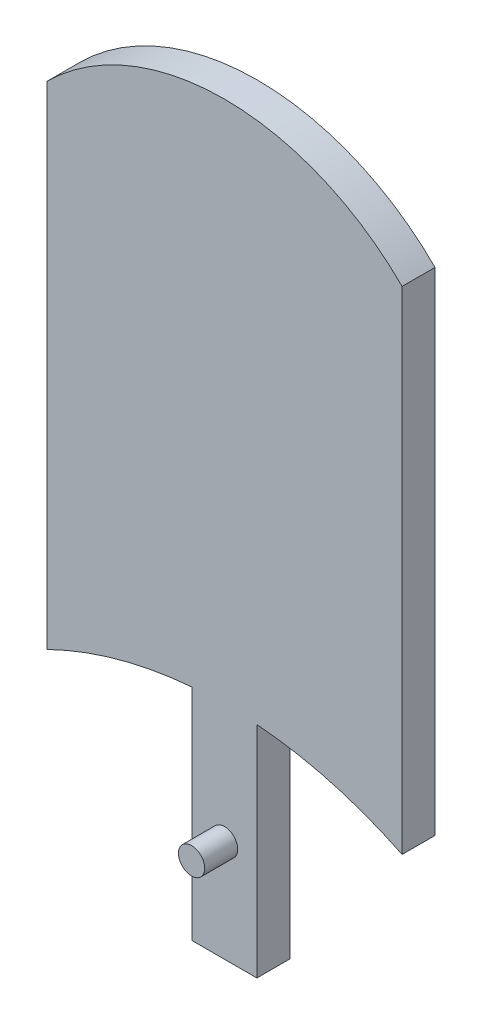
ISO-10303-21;
HEADER;
FILE_DESCRIPTION(('STEP AP214'),'2;1');
FILE_NAME('part.step','',(''),(''),'','','');
FILE_SCHEMA(('AUTOMOTIVE_DESIGN { 1 0 10303 214 1 1 1 1 }'));
ENDSEC;
DATA;
#1=APPLICATION_CONTEXT('core data for automotive mechanical design processes');
#2=APPLICATION_PROTOCOL_DEFINITION('international standard','automotive_design',2000,#1);
#3=PRODUCT_CONTEXT('',#1,'mechanical');
#4=PRODUCT('Part','Part','',(#3));
#5=PRODUCT_RELATED_PRODUCT_CATEGORY('part','',(#4));
#6=PRODUCT_DEFINITION_FORMATION('','',#4);
#7=PRODUCT_DEFINITION_CONTEXT('part definition',#1,'design');
#8=PRODUCT_DEFINITION('design','',#6,#7);
#9=PRODUCT_DEFINITION_SHAPE('','',#8);
#10=(LENGTH_UNIT() NAMED_UNIT(*) SI_UNIT(.MILLI.,.METRE.));
#11=(NAMED_UNIT(*) PLANE_ANGLE_UNIT() SI_UNIT($,.RADIAN.));
#12=(NAMED_UNIT(*) SI_UNIT($,.STERADIAN.) SOLID_ANGLE_UNIT());
#13=UNCERTAINTY_MEASURE_WITH_UNIT(LENGTH_MEASURE(1.E-05),#10,'distance_accuracy_value','');
#14=(GEOMETRIC_REPRESENTATION_CONTEXT(3) GLOBAL_UNCERTAINTY_ASSIGNED_CONTEXT((#13)) GLOBAL_UNIT_ASSIGNED_CONTEXT((#10,
#11,#12)) REPRESENTATION_CONTEXT('',''));
#15=CARTESIAN_POINT('',(0.,0.,0.));
#16=DIRECTION('',(0.,0.,1.));
#17=DIRECTION('',(1.,0.,0.));
#18=AXIS2_PLACEMENT_3D('',#15,#16,#17);
#19=CARTESIAN_POINT('',(0.,23.2983529403055,-3.175));
#20=DIRECTION('',(0.,1.,0.));
#21=DIRECTION('',(0.,0.,1.));
#22=AXIS2_PLACEMENT_3D('',#19,#20,#21);
#23=PLANE('',#22);
#24=DIRECTION('',(0.,0.,-1.));
#25=VECTOR('',#24,1.);
#26=CARTESIAN_POINT('',(1.01599999999999,23.2983529403055,6.351));
#27=LINE('',#26,#25);
#28=CARTESIAN_POINT('',(1.01599999999999,23.2983529403055,-2.286));
#29=VERTEX_POINT('',#28);
#30=CARTESIAN_POINT('',(1.01599999999999,23.2983529403055,-3.175));
#31=VERTEX_POINT('',#30);
#32=EDGE_CURVE('E452',#29,#31,#27,.T.);
#33=ORIENTED_EDGE('',*,*,#32,.F.);
#34=DIRECTION('',(1.,0.,0.));
#35=VECTOR('',#34,1.);
#36=CARTESIAN_POINT('',(-17.1162533328683,23.2983529403055,-2.286));
#37=LINE('',#36,#35);
#38=CARTESIAN_POINT('',(1.65128861988301,23.2983529403055,-2.286));
#39=VERTEX_POINT('',#38);
#40=EDGE_CURVE('E216',#29,#39,#37,.T.);
#41=ORIENTED_EDGE('',*,*,#40,.T.);
#42=DIRECTION('',(0.,0.,1.));
#43=VECTOR('',#42,1.);
#44=CARTESIAN_POINT('',(1.65128861988301,23.2983529403055,-3.175));
#45=LINE('',#44,#43);
#46=CARTESIAN_POINT('',(1.65128861988301,23.2983529403055,0.));
#47=VERTEX_POINT('',#46);
#48=EDGE_CURVE('E312',#39,#47,#45,.T.);
#49=ORIENTED_EDGE('',*,*,#48,.T.);
#50=DIRECTION('',(-1.,0.,0.));
#51=VECTOR('',#50,1.);
#52=CARTESIAN_POINT('',(0.,23.2983529403055,0.));
#53=LINE('',#52,#51);
#54=CARTESIAN_POINT('',(2.85342673515783,23.2983529403055,0.));
#55=VERTEX_POINT('',#54);
#56=EDGE_CURVE('E292',#55,#47,#53,.T.);
#57=ORIENTED_EDGE('',*,*,#56,.F.);
#58=DIRECTION('',(0.,0.,1.));
#59=VECTOR('',#58,1.);
#60=CARTESIAN_POINT('',(2.85342673515783,23.2983529403055,-3.175));
#61=LINE('',#60,#59);
#62=CARTESIAN_POINT('',(2.85342673515783,23.2983529403055,-3.175));
#63=VERTEX_POINT('',#62);
#64=EDGE_CURVE('E308',#63,#55,#61,.T.);
#65=ORIENTED_EDGE('',*,*,#64,.F.);
#66=DIRECTION('',(-1.,0.,0.));
#67=VECTOR('',#66,1.);
#68=CARTESIAN_POINT('',(0.,23.2983529403055,-3.175));
#69=LINE('',#68,#67);
#70=EDGE_CURVE('E274',#63,#31,#69,.T.);
#71=ORIENTED_EDGE('',*,*,#70,.T.);
#72=EDGE_LOOP('',(#33,#41,#49,#57,#65,#71));
#73=FACE_BOUND('',#72,.T.);
#74=ADVANCED_FACE('F47',(#73),#23,.T.);
#75=CARTESIAN_POINT('',(0.,0.,-3.175));
#76=DIRECTION('',(0.,0.,-1.));
#77=DIRECTION('',(-1.,0.,0.));
#78=AXIS2_PLACEMENT_3D('',#75,#76,#77);
#79=PLANE('',#78);
#80=DIRECTION('',(0.,-1.,0.));
#81=VECTOR('',#80,1.);
#82=CARTESIAN_POINT('',(1.01599999999999,-19.7679282566195,-3.175));
#83=LINE('',#82,#81);
#84=CARTESIAN_POINT('',(1.016,-19.7679282566195,-3.175));
#85=VERTEX_POINT('',#84);
#86=EDGE_CURVE('E71',#31,#85,#83,.T.);
#87=ORIENTED_EDGE('',*,*,#86,.F.);
#88=ORIENTED_EDGE('',*,*,#70,.F.);
#89=DIRECTION('',(0.,1.,0.));
#90=VECTOR('',#89,1.);
#91=CARTESIAN_POINT('',(2.85342673515783,0.,-3.175));
#92=LINE('',#91,#90);
#93=CARTESIAN_POINT('',(2.85342673515783,-19.8377816235629,-3.175));
#94=VERTEX_POINT('',#93);
#95=EDGE_CURVE('E278',#94,#63,#92,.T.);
#96=ORIENTED_EDGE('',*,*,#95,.F.);
#97=CARTESIAN_POINT('',(0.,-58.5646946603465,-3.175));
#98=DIRECTION('',(0.,0.,-1.));
#99=DIRECTION('',(-1.,0.,0.));
#100=AXIS2_PLACEMENT_3D('',#97,#98,#99);
#101=CIRCLE('',#100,38.8318920153463);
#102=CARTESIAN_POINT('',(1.65128861988301,-19.7679282566195,-3.175));
#103=VERTEX_POINT('',#102);
#104=EDGE_CURVE('E283',#94,#103,#101,.F.);
#105=ORIENTED_EDGE('',*,*,#104,.T.);
#106=DIRECTION('',(1.,0.,0.));
#107=VECTOR('',#106,1.);
#108=CARTESIAN_POINT('',(-17.1162533328683,-19.7679282566195,-3.175));
#109=LINE('',#108,#107);
#110=EDGE_CURVE('E446',#85,#103,#109,.T.);
#111=ORIENTED_EDGE('',*,*,#110,.F.);
#112=EDGE_LOOP('',(#87,#88,#96,#105,#111));
#113=FACE_BOUND('',#112,.T.);
#114=ADVANCED_FACE('F451',(#113),#79,.T.);
#115=CARTESIAN_POINT('',(-17.1162533328683,23.2983529403055,-2.286));
#116=DIRECTION('',(0.,0.,-1.));
#117=DIRECTION('',(0.,1.,0.));
#118=AXIS2_PLACEMENT_3D('',#115,#116,#117);
#119=PLANE('',#118);
#120=ORIENTED_EDGE('',*,*,#40,.F.);
#121=DIRECTION('',(0.,1.,0.));
#122=VECTOR('',#121,1.);
#123=CARTESIAN_POINT('',(1.01599999999999,-19.7679282566195,-2.28599999999999));
#124=LINE('',#123,#122);
#125=CARTESIAN_POINT('',(1.01599999999999,-19.7679282566195,-2.28599999999999));
#126=VERTEX_POINT('',#125);
#127=EDGE_CURVE('E208',#126,#29,#124,.T.);
#128=ORIENTED_EDGE('',*,*,#127,.F.);
#129=DIRECTION('',(1.,0.,0.));
#130=VECTOR('',#129,1.);
#131=CARTESIAN_POINT('',(-17.1162533328683,-19.7679282566195,-2.28599999999999));
#132=LINE('',#131,#130);
#133=CARTESIAN_POINT('',(1.65128861988301,-19.7679282566195,-2.28599999999999));
#134=VERTEX_POINT('',#133);
#135=EDGE_CURVE('E444',#126,#134,#132,.T.);
#136=ORIENTED_EDGE('',*,*,#135,.T.);
#137=DIRECTION('',(0.,1.,0.));
#138=VECTOR('',#137,1.);
#139=CARTESIAN_POINT('',(1.65128861988301,23.2983529403055,-2.286));
#140=LINE('',#139,#138);
#141=EDGE_CURVE('E215',#134,#39,#140,.T.);
#142=ORIENTED_EDGE('',*,*,#141,.T.);
#143=EDGE_LOOP('',(#120,#128,#136,#142));
#144=FACE_BOUND('',#143,.T.);
#145=ADVANCED_FACE('F457',(#144),#119,.F.);
#146=CARTESIAN_POINT('',(-17.1162533328683,-19.7679282566195,-2.28599999999999));
#147=DIRECTION('',(0.,1.,0.));
#148=DIRECTION('',(0.,0.,1.));
#149=AXIS2_PLACEMENT_3D('',#146,#147,#148);
#150=PLANE('',#149);
#151=ORIENTED_EDGE('',*,*,#135,.F.);
#152=DIRECTION('',(0.,0.,-1.));
#153=VECTOR('',#152,1.);
#154=CARTESIAN_POINT('',(1.01599999999999,-19.7679282566195,6.351));
#155=LINE('',#154,#153);
#156=EDGE_CURVE('E447',#126,#85,#155,.T.);
#157=ORIENTED_EDGE('',*,*,#156,.T.);
#158=ORIENTED_EDGE('',*,*,#110,.T.);
#159=DIRECTION('',(0.,0.,1.));
#160=VECTOR('',#159,1.);
#161=CARTESIAN_POINT('',(1.65128861988301,-19.7679282566195,-3.175));
#162=LINE('',#161,#160);
#163=EDGE_CURVE('E300',#103,#134,#162,.T.);
#164=ORIENTED_EDGE('',*,*,#163,.T.);
#165=EDGE_LOOP('',(#151,#157,#158,#164));
#166=FACE_BOUND('',#165,.T.);
#167=ADVANCED_FACE('F443',(#166),#150,.F.);
#168=CARTESIAN_POINT('',(-1.65128861988301,0.,-3.175));
#169=DIRECTION('',(1.,0.,0.));
#170=DIRECTION('',(0.,0.,-1.));
#171=AXIS2_PLACEMENT_3D('',#168,#169,#170);
#172=PLANE('',#171);
#173=DIRECTION('',(0.,0.,1.));
#174=VECTOR('',#173,1.);
#175=CARTESIAN_POINT('',(-1.65128861988301,-19.7679282566195,-3.175));
#176=LINE('',#175,#174);
#177=CARTESIAN_POINT('',(-1.65128861988301,-19.7679282566195,-2.28599999999999));
#178=VERTEX_POINT('',#177);
#179=CARTESIAN_POINT('',(-1.65128861988301,-19.7679282566195,0.));
#180=VERTEX_POINT('',#179);
#181=EDGE_CURVE('E325',#178,#180,#176,.T.);
#182=ORIENTED_EDGE('',*,*,#181,.F.);
#183=DIRECTION('',(0.,-1.,0.));
#184=VECTOR('',#183,1.);
#185=CARTESIAN_POINT('',(-1.65128861988301,23.2983529403055,-2.286));
#186=LINE('',#185,#184);
#187=CARTESIAN_POINT('',(-1.65128861988301,23.2983529403055,-2.286));
#188=VERTEX_POINT('',#187);
#189=EDGE_CURVE('E196',#188,#178,#186,.T.);
#190=ORIENTED_EDGE('',*,*,#189,.F.);
#191=DIRECTION('',(0.,0.,1.));
#192=VECTOR('',#191,1.);
#193=CARTESIAN_POINT('',(-1.65128861988301,23.2983529403055,-3.175));
#194=LINE('',#193,#192);
#195=CARTESIAN_POINT('',(-1.65128861988301,23.2983529403055,0.));
#196=VERTEX_POINT('',#195);
#197=EDGE_CURVE('E213',#188,#196,#194,.T.);
#198=ORIENTED_EDGE('',*,*,#197,.T.);
#199=DIRECTION('',(0.,1.,0.));
#200=VECTOR('',#199,1.);
#201=CARTESIAN_POINT('',(-1.65128861988301,0.,0.));
#202=LINE('',#201,#200);
#203=EDGE_CURVE('E321',#180,#196,#202,.T.);
#204=ORIENTED_EDGE('',*,*,#203,.F.);
#205=EDGE_LOOP('',(#182,#190,#198,#204));
#206=FACE_BOUND('',#205,.T.);
#207=ADVANCED_FACE('F514',(#206),#172,.T.);
#208=CARTESIAN_POINT('',(1.65128861988301,0.,-3.175));
#209=DIRECTION('',(1.,0.,0.));
#210=DIRECTION('',(0.,0.,-1.));
#211=AXIS2_PLACEMENT_3D('',#208,#209,#210);
#212=PLANE('',#211);
#213=ORIENTED_EDGE('',*,*,#141,.F.);
#214=CARTESIAN_POINT('',(1.65128861988301,-19.7679282566195,0.));
#215=VERTEX_POINT('',#214);
#216=EDGE_CURVE('E287',#134,#215,#162,.T.);
#217=ORIENTED_EDGE('',*,*,#216,.T.);
#218=DIRECTION('',(0.,1.,0.));
#219=VECTOR('',#218,1.);
#220=CARTESIAN_POINT('',(1.65128861988301,0.,0.));
#221=LINE('',#220,#219);
#222=EDGE_CURVE('E288',#215,#47,#221,.T.);
#223=ORIENTED_EDGE('',*,*,#222,.T.);
#224=ORIENTED_EDGE('',*,*,#48,.F.);
#225=EDGE_LOOP('',(#213,#217,#223,#224));
#226=FACE_BOUND('',#225,.T.);
#227=ADVANCED_FACE('F440',(#226),#212,.F.);
#228=CARTESIAN_POINT('',(0.,-58.5646946603465,3.175));
#229=DIRECTION('',(0.,0.,-1.));
#230=DIRECTION('',(-1.,0.,0.));
#231=AXIS2_PLACEMENT_3D('',#228,#229,#230);
#232=CYLINDRICAL_SURFACE('',#231,38.8318920153463);
#233=CARTESIAN_POINT('',(0.,-58.5646946603465,3.175));
#234=DIRECTION('',(0.,0.,1.));
#235=DIRECTION('',(1.,0.,0.));
#236=AXIS2_PLACEMENT_3D('',#233,#234,#235);
#237=CIRCLE('',#236,38.8318920153463);
#238=CARTESIAN_POINT('',(3.11847985069032,-19.8582233549904,3.175));
#239=VERTEX_POINT('',#238);
#240=CARTESIAN_POINT('',(17.1142533328683,-23.707583903,3.175));
#241=VERTEX_POINT('',#240);
#242=EDGE_CURVE('E357',#239,#241,#237,.F.);
#243=ORIENTED_EDGE('',*,*,#242,.F.);
#244=DIRECTION('',(0.,0.,-1.));
#245=VECTOR('',#244,1.);
#246=CARTESIAN_POINT('',(3.11847985069032,-19.8582233549904,3.175));
#247=LINE('',#246,#245);
#248=CARTESIAN_POINT('',(3.11847985069032,-19.8582233549904,0.));
#249=VERTEX_POINT('',#248);
#250=EDGE_CURVE('E269',#239,#249,#247,.T.);
#251=ORIENTED_EDGE('',*,*,#250,.T.);
#252=CARTESIAN_POINT('',(0.,-58.5646946603465,0.));
#253=DIRECTION('',(0.,0.,1.));
#254=DIRECTION('',(1.,0.,0.));
#255=AXIS2_PLACEMENT_3D('',#252,#253,#254);
#256=CIRCLE('',#255,38.8318920153463);
#257=CARTESIAN_POINT('',(17.1142533328683,-23.707583903,0.));
#258=VERTEX_POINT('',#257);
#259=EDGE_CURVE('E373',#249,#258,#256,.F.);
#260=ORIENTED_EDGE('',*,*,#259,.T.);
#261=DIRECTION('',(0.,0.,-1.));
#262=VECTOR('',#261,1.);
#263=CARTESIAN_POINT('',(17.1142533328683,-23.707583903,3.175));
#264=LINE('',#263,#262);
#265=EDGE_CURVE('E383',#241,#258,#264,.T.);
#266=ORIENTED_EDGE('',*,*,#265,.F.);
#267=EDGE_LOOP('',(#243,#251,#260,#266));
#268=FACE_BOUND('',#267,.T.);
#269=ADVANCED_FACE('F413',(#268),#232,.F.);
#270=CARTESIAN_POINT('',(0.,-58.5646946603465,0.));
#271=DIRECTION('',(0.,0.,1.));
#272=DIRECTION('',(1.,0.,0.));
#273=AXIS2_PLACEMENT_3D('',#270,#271,#272);
#274=CIRCLE('',#273,38.8318920153463);
#275=CARTESIAN_POINT('',(-2.85342673515783,-19.8377816235629,0.));
#276=VERTEX_POINT('',#275);
#277=EDGE_CURVE('E261',#276,#180,#274,.F.);
#278=ORIENTED_EDGE('',*,*,#277,.F.);
#279=DIRECTION('',(0.,0.,1.));
#280=VECTOR('',#279,1.);
#281=CARTESIAN_POINT('',(-2.85342673515783,-19.8377816235629,-3.175));
#282=LINE('',#281,#280);
#283=CARTESIAN_POINT('',(-2.85342673515783,-19.8377816235629,-3.175));
#284=VERTEX_POINT('',#283);
#285=EDGE_CURVE('E293',#284,#276,#282,.T.);
#286=ORIENTED_EDGE('',*,*,#285,.F.);
#287=CARTESIAN_POINT('',(0.,-58.5646946603465,-3.175));
#288=DIRECTION('',(0.,0.,-1.));
#289=DIRECTION('',(-1.,0.,0.));
#290=AXIS2_PLACEMENT_3D('',#287,#288,#289);
#291=CIRCLE('',#290,38.8318920153463);
#292=CARTESIAN_POINT('',(-1.65128861988301,-19.7679282566195,-3.175));
#293=VERTEX_POINT('',#292);
#294=EDGE_CURVE('E316',#293,#284,#291,.F.);
#295=ORIENTED_EDGE('',*,*,#294,.F.);
#296=EDGE_CURVE('E335',#293,#178,#176,.T.);
#297=ORIENTED_EDGE('',*,*,#296,.T.);
#298=ORIENTED_EDGE('',*,*,#181,.T.);
#299=EDGE_LOOP('',(#278,#286,#295,#297,#298));
#300=FACE_BOUND('',#299,.T.);
#301=ADVANCED_FACE('F603',(#300),#232,.F.);
#302=CARTESIAN_POINT('',(2.85342673515783,-19.8377816235629,0.));
#303=VERTEX_POINT('',#302);
#304=EDGE_CURVE('E257',#215,#303,#274,.F.);
#305=ORIENTED_EDGE('',*,*,#304,.F.);
#306=ORIENTED_EDGE('',*,*,#216,.F.);
#307=ORIENTED_EDGE('',*,*,#163,.F.);
#308=ORIENTED_EDGE('',*,*,#104,.F.);
#309=DIRECTION('',(0.,0.,1.));
#310=VECTOR('',#309,1.);
#311=CARTESIAN_POINT('',(2.85342673515783,-19.8377816235629,-3.175));
#312=LINE('',#311,#310);
#313=EDGE_CURVE('E304',#94,#303,#312,.T.);
#314=ORIENTED_EDGE('',*,*,#313,.T.);
#315=EDGE_LOOP('',(#305,#306,#307,#308,#314));
#316=FACE_BOUND('',#315,.T.);
#317=ADVANCED_FACE('F427',(#316),#232,.F.);
#318=CARTESIAN_POINT('',(0.,0.,0.));
#319=DIRECTION('',(0.,0.,1.));
#320=DIRECTION('',(1.,0.,0.));
#321=AXIS2_PLACEMENT_3D('',#318,#319,#320);
#322=PLANE('',#321);
#323=DIRECTION('',(0.,-1.,0.));
#324=VECTOR('',#323,1.);
#325=CARTESIAN_POINT('',(-3.11847985069032,0.338888516574702,0.));
#326=LINE('',#325,#324);
#327=CARTESIAN_POINT('',(-3.11847985069039,-19.8582233549904,0.));
#328=VERTEX_POINT('',#327);
#329=CARTESIAN_POINT('',(-3.11847985069047,-41.0138230374253,0.));
#330=VERTEX_POINT('',#329);
#331=EDGE_CURVE('E237',#328,#330,#326,.T.);
#332=ORIENTED_EDGE('',*,*,#331,.F.);
#333=CARTESIAN_POINT('',(-17.1142533328683,-23.707583903,0.));
#334=VERTEX_POINT('',#333);
#335=EDGE_CURVE('E374',#334,#328,#256,.F.);
#336=ORIENTED_EDGE('',*,*,#335,.F.);
#337=DIRECTION('',(0.,1.,0.));
#338=VECTOR('',#337,1.);
#339=CARTESIAN_POINT('',(-17.1142533328683,0.,0.));
#340=LINE('',#339,#338);
#341=CARTESIAN_POINT('',(-17.1142533328683,23.707583903,0.));
#342=VERTEX_POINT('',#341);
#343=EDGE_CURVE('E369',#334,#342,#340,.T.);
#344=ORIENTED_EDGE('',*,*,#343,.T.);
#345=CARTESIAN_POINT('',(0.,6.54428719014116,0.));
#346=DIRECTION('',(0.,0.,1.));
#347=DIRECTION('',(1.,0.,0.));
#348=AXIS2_PLACEMENT_3D('',#345,#346,#347);
#349=CIRCLE('',#348,24.2379128885971);
#350=CARTESIAN_POINT('',(17.1142533328683,23.707583903,0.));
#351=VERTEX_POINT('',#350);
#352=EDGE_CURVE('E315',#342,#351,#349,.F.);
#353=ORIENTED_EDGE('',*,*,#352,.T.);
#354=DIRECTION('',(0.,1.,0.));
#355=VECTOR('',#354,1.);
#356=CARTESIAN_POINT('',(17.1142533328683,0.,0.));
#357=LINE('',#356,#355);
#358=EDGE_CURVE('E353',#258,#351,#357,.T.);
#359=ORIENTED_EDGE('',*,*,#358,.F.);
#360=ORIENTED_EDGE('',*,*,#259,.F.);
#361=DIRECTION('',(0.,1.,0.));
#362=VECTOR('',#361,1.);
#363=CARTESIAN_POINT('',(3.11847985069032,0.338888516574709,0.));
#364=LINE('',#363,#362);
#365=CARTESIAN_POINT('',(3.11847985069032,-41.0138230374253,0.));
#366=VERTEX_POINT('',#365);
#367=EDGE_CURVE('E234',#366,#249,#364,.T.);
#368=ORIENTED_EDGE('',*,*,#367,.F.);
#369=DIRECTION('',(1.,0.,0.));
#370=VECTOR('',#369,1.);
#371=CARTESIAN_POINT('',(-3.11847985069047,-41.0138230374253,0.));
#372=LINE('',#371,#370);
#373=EDGE_CURVE('E241',#330,#366,#372,.T.);
#374=ORIENTED_EDGE('',*,*,#373,.F.);
#375=EDGE_LOOP('',(#332,#336,#344,#353,#359,#360,#368,#374));
#376=FACE_BOUND('',#375,.T.);
#377=DIRECTION('',(0.,1.,0.));
#378=VECTOR('',#377,1.);
#379=CARTESIAN_POINT('',(2.85342673515783,0.,0.));
#380=LINE('',#379,#378);
#381=EDGE_CURVE('E297',#303,#55,#380,.T.);
#382=ORIENTED_EDGE('',*,*,#381,.T.);
#383=ORIENTED_EDGE('',*,*,#56,.T.);
#384=ORIENTED_EDGE('',*,*,#222,.F.);
#385=ORIENTED_EDGE('',*,*,#304,.T.);
#386=EDGE_LOOP('',(#382,#383,#384,#385));
#387=FACE_BOUND('',#386,.T.);
#388=ORIENTED_EDGE('',*,*,#203,.T.);
#389=DIRECTION('',(-1.,0.,0.));
#390=VECTOR('',#389,1.);
#391=CARTESIAN_POINT('',(0.,23.2983529403055,0.));
#392=LINE('',#391,#390);
#393=CARTESIAN_POINT('',(-2.85342673515783,23.2983529403055,0.));
#394=VERTEX_POINT('',#393);
#395=EDGE_CURVE('E328',#196,#394,#392,.T.);
#396=ORIENTED_EDGE('',*,*,#395,.T.);
#397=DIRECTION('',(0.,1.,0.));
#398=VECTOR('',#397,1.);
#399=CARTESIAN_POINT('',(-2.85342673515783,0.,0.));
#400=LINE('',#399,#398);
#401=EDGE_CURVE('E273',#276,#394,#400,.T.);
#402=ORIENTED_EDGE('',*,*,#401,.F.);
#403=ORIENTED_EDGE('',*,*,#277,.T.);
#404=EDGE_LOOP('',(#388,#396,#402,#403));
#405=FACE_BOUND('',#404,.T.);
#406=ADVANCED_FACE('F396',(#376,#387,#405),#322,.F.);
#407=CARTESIAN_POINT('',(0.,6.54428719014116,3.175));
#408=DIRECTION('',(0.,0.,-1.));
#409=DIRECTION('',(-1.,0.,0.));
#410=AXIS2_PLACEMENT_3D('',#407,#408,#409);
#411=CYLINDRICAL_SURFACE('',#410,24.2379128885971);
#412=ORIENTED_EDGE('',*,*,#352,.F.);
#413=DIRECTION('',(0.,0.,-1.));
#414=VECTOR('',#413,1.);
#415=CARTESIAN_POINT('',(-17.1142533328683,23.707583903,3.175));
#416=LINE('',#415,#414);
#417=CARTESIAN_POINT('',(-17.1142533328683,23.707583903,3.175));
#418=VERTEX_POINT('',#417);
#419=EDGE_CURVE('E11',#418,#342,#416,.T.);
#420=ORIENTED_EDGE('',*,*,#419,.F.);
#421=CARTESIAN_POINT('',(0.,6.54428719014116,3.175));
#422=DIRECTION('',(0.,0.,1.));
#423=DIRECTION('',(1.,0.,0.));
#424=AXIS2_PLACEMENT_3D('',#421,#422,#423);
#425=CIRCLE('',#424,24.2379128885971);
#426=CARTESIAN_POINT('',(17.1142533328683,23.707583903,3.175));
#427=VERTEX_POINT('',#426);
#428=EDGE_CURVE('E348',#418,#427,#425,.F.);
#429=ORIENTED_EDGE('',*,*,#428,.T.);
#430=DIRECTION('',(0.,0.,-1.));
#431=VECTOR('',#430,1.);
#432=CARTESIAN_POINT('',(17.1142533328683,23.707583903,3.175));
#433=LINE('',#432,#431);
#434=EDGE_CURVE('E365',#427,#351,#433,.T.);
#435=ORIENTED_EDGE('',*,*,#434,.T.);
#436=EDGE_LOOP('',(#412,#420,#429,#435));
#437=FACE_BOUND('',#436,.T.);
#438=ADVANCED_FACE('F49',(#437),#411,.T.);
#439=CARTESIAN_POINT('',(-17.1142533328683,0.,3.175));
#440=DIRECTION('',(-1.,0.,0.));
#441=DIRECTION('',(0.,0.,1.));
#442=AXIS2_PLACEMENT_3D('',#439,#440,#441);
#443=PLANE('',#442);
#444=ORIENTED_EDGE('',*,*,#343,.F.);
#445=DIRECTION('',(0.,0.,-1.));
#446=VECTOR('',#445,1.);
#447=CARTESIAN_POINT('',(-17.1142533328683,-23.707583903,3.175));
#448=LINE('',#447,#446);
#449=CARTESIAN_POINT('',(-17.1142533328683,-23.707583903,3.175));
#450=VERTEX_POINT('',#449);
#451=EDGE_CURVE('E56',#450,#334,#448,.T.);
#452=ORIENTED_EDGE('',*,*,#451,.F.);
#453=DIRECTION('',(0.,1.,0.));
#454=VECTOR('',#453,1.);
#455=CARTESIAN_POINT('',(-17.1142533328683,0.,3.175));
#456=LINE('',#455,#454);
#457=EDGE_CURVE('E352',#450,#418,#456,.T.);
#458=ORIENTED_EDGE('',*,*,#457,.T.);
#459=ORIENTED_EDGE('',*,*,#419,.T.);
#460=EDGE_LOOP('',(#444,#452,#458,#459));
#461=FACE_BOUND('',#460,.T.);
#462=ADVANCED_FACE('F399',(#461),#443,.T.);
#463=ORIENTED_EDGE('',*,*,#335,.T.);
#464=DIRECTION('',(0.,0.,-1.));
#465=VECTOR('',#464,1.);
#466=CARTESIAN_POINT('',(-3.11847985069039,-19.8582233549904,3.175));
#467=LINE('',#466,#465);
#468=CARTESIAN_POINT('',(-3.11847985069039,-19.8582233549904,3.175));
#469=VERTEX_POINT('',#468);
#470=EDGE_CURVE('E265',#328,#469,#467,.F.);
#471=ORIENTED_EDGE('',*,*,#470,.T.);
#472=EDGE_CURVE('E358',#450,#469,#237,.F.);
#473=ORIENTED_EDGE('',*,*,#472,.F.);
#474=ORIENTED_EDGE('',*,*,#451,.T.);
#475=EDGE_LOOP('',(#463,#471,#473,#474));
#476=FACE_BOUND('',#475,.T.);
#477=ADVANCED_FACE('F390',(#476),#232,.F.);
#478=CARTESIAN_POINT('',(17.1142533328683,0.,3.175));
#479=DIRECTION('',(-1.,0.,0.));
#480=DIRECTION('',(0.,0.,1.));
#481=AXIS2_PLACEMENT_3D('',#478,#479,#480);
#482=PLANE('',#481);
#483=ORIENTED_EDGE('',*,*,#358,.T.);
#484=ORIENTED_EDGE('',*,*,#434,.F.);
#485=DIRECTION('',(0.,1.,0.));
#486=VECTOR('',#485,1.);
#487=CARTESIAN_POINT('',(17.1142533328683,0.,3.175));
#488=LINE('',#487,#486);
#489=EDGE_CURVE('E362',#241,#427,#488,.T.);
#490=ORIENTED_EDGE('',*,*,#489,.F.);
#491=ORIENTED_EDGE('',*,*,#265,.T.);
#492=EDGE_LOOP('',(#483,#484,#490,#491));
#493=FACE_BOUND('',#492,.T.);
#494=ADVANCED_FACE('F408',(#493),#482,.F.);
#495=CARTESIAN_POINT('',(0.,0.,3.175));
#496=DIRECTION('',(0.,0.,1.));
#497=DIRECTION('',(1.,0.,0.));
#498=AXIS2_PLACEMENT_3D('',#495,#496,#497);
#499=PLANE('',#498);
#500=CARTESIAN_POINT('',(0.,-31.2016834034253,3.175));
#501=DIRECTION('',(0.,0.,1.));
#502=DIRECTION('',(1.,0.,0.));
#503=AXIS2_PLACEMENT_3D('',#500,#501,#502);
#504=CIRCLE('',#503,1.27);
#505=CARTESIAN_POINT('',(1.27,-31.2016834034253,3.175));
#506=VERTEX_POINT('',#505);
#507=EDGE_CURVE('E221',#506,#506,#504,.T.);
#508=ORIENTED_EDGE('',*,*,#507,.F.);
#509=EDGE_LOOP('',(#508));
#510=FACE_BOUND('',#509,.T.);
#511=ORIENTED_EDGE('',*,*,#472,.T.);
#512=DIRECTION('',(0.,-1.,0.));
#513=VECTOR('',#512,1.);
#514=CARTESIAN_POINT('',(-3.11847985069032,0.338888516574702,3.175));
#515=LINE('',#514,#513);
#516=CARTESIAN_POINT('',(-3.11847985069047,-41.0138230374253,3.175));
#517=VERTEX_POINT('',#516);
#518=EDGE_CURVE('E248',#469,#517,#515,.T.);
#519=ORIENTED_EDGE('',*,*,#518,.T.);
#520=DIRECTION('',(1.,0.,0.));
#521=VECTOR('',#520,1.);
#522=CARTESIAN_POINT('',(-3.11847985069047,-41.0138230374253,3.175));
#523=LINE('',#522,#521);
#524=CARTESIAN_POINT('',(3.11847985069032,-41.0138230374253,3.175));
#525=VERTEX_POINT('',#524);
#526=EDGE_CURVE('E238',#517,#525,#523,.T.);
#527=ORIENTED_EDGE('',*,*,#526,.T.);
#528=DIRECTION('',(0.,1.,0.));
#529=VECTOR('',#528,1.);
#530=CARTESIAN_POINT('',(3.11847985069032,0.338888516574709,3.175));
#531=LINE('',#530,#529);
#532=EDGE_CURVE('E230',#525,#239,#531,.T.);
#533=ORIENTED_EDGE('',*,*,#532,.T.);
#534=ORIENTED_EDGE('',*,*,#242,.T.);
#535=ORIENTED_EDGE('',*,*,#489,.T.);
#536=ORIENTED_EDGE('',*,*,#428,.F.);
#537=ORIENTED_EDGE('',*,*,#457,.F.);
#538=EDGE_LOOP('',(#511,#519,#527,#533,#534,#535,#536,#537));
#539=FACE_BOUND('',#538,.T.);
#540=ADVANCED_FACE('F504',(#510,#539),#499,.T.);
#541=CARTESIAN_POINT('',(-2.85342673515783,0.,-3.175));
#542=DIRECTION('',(1.,0.,0.));
#543=DIRECTION('',(0.,0.,-1.));
#544=AXIS2_PLACEMENT_3D('',#541,#542,#543);
#545=PLANE('',#544);
#546=ORIENTED_EDGE('',*,*,#401,.T.);
#547=DIRECTION('',(0.,0.,1.));
#548=VECTOR('',#547,1.);
#549=CARTESIAN_POINT('',(-2.85342673515783,23.2983529403055,-3.175));
#550=LINE('',#549,#548);
#551=CARTESIAN_POINT('',(-2.85342673515783,23.2983529403055,-3.175));
#552=VERTEX_POINT('',#551);
#553=EDGE_CURVE('E341',#552,#394,#550,.T.);
#554=ORIENTED_EDGE('',*,*,#553,.F.);
#555=DIRECTION('',(0.,1.,0.));
#556=VECTOR('',#555,1.);
#557=CARTESIAN_POINT('',(-2.85342673515783,0.,-3.175));
#558=LINE('',#557,#556);
#559=EDGE_CURVE('E320',#284,#552,#558,.T.);
#560=ORIENTED_EDGE('',*,*,#559,.F.);
#561=ORIENTED_EDGE('',*,*,#285,.T.);
#562=EDGE_LOOP('',(#546,#554,#560,#561));
#563=FACE_BOUND('',#562,.T.);
#564=ADVANCED_FACE('F497',(#563),#545,.F.);
#565=DIRECTION('',(0.,0.,-1.));
#566=VECTOR('',#565,1.);
#567=CARTESIAN_POINT('',(-1.016,23.2983529403055,6.351));
#568=LINE('',#567,#566);
#569=CARTESIAN_POINT('',(-1.016,23.2983529403055,-2.286));
#570=VERTEX_POINT('',#569);
#571=CARTESIAN_POINT('',(-1.016,23.2983529403055,-3.175));
#572=VERTEX_POINT('',#571);
#573=EDGE_CURVE('E188',#570,#572,#568,.T.);
#574=ORIENTED_EDGE('',*,*,#573,.T.);
#575=EDGE_CURVE('E279',#572,#552,#69,.T.);
#576=ORIENTED_EDGE('',*,*,#575,.T.);
#577=ORIENTED_EDGE('',*,*,#553,.T.);
#578=ORIENTED_EDGE('',*,*,#395,.F.);
#579=ORIENTED_EDGE('',*,*,#197,.F.);
#580=EDGE_CURVE('E204',#188,#570,#37,.T.);
#581=ORIENTED_EDGE('',*,*,#580,.T.);
#582=EDGE_LOOP('',(#574,#576,#577,#578,#579,#581));
#583=FACE_BOUND('',#582,.T.);
#584=ADVANCED_FACE('F211',(#583),#23,.T.);
#585=CARTESIAN_POINT('',(2.85342673515783,0.,-3.175));
#586=DIRECTION('',(1.,0.,0.));
#587=DIRECTION('',(0.,0.,-1.));
#588=AXIS2_PLACEMENT_3D('',#585,#586,#587);
#589=PLANE('',#588);
#590=ORIENTED_EDGE('',*,*,#381,.F.);
#591=ORIENTED_EDGE('',*,*,#313,.F.);
#592=ORIENTED_EDGE('',*,*,#95,.T.);
#593=ORIENTED_EDGE('',*,*,#64,.T.);
#594=EDGE_LOOP('',(#590,#591,#592,#593));
#595=FACE_BOUND('',#594,.T.);
#596=ADVANCED_FACE('F431',(#595),#589,.T.);
#597=DIRECTION('',(0.,1.,0.));
#598=VECTOR('',#597,1.);
#599=CARTESIAN_POINT('',(-1.016,23.2983529403055,-3.175));
#600=LINE('',#599,#598);
#601=CARTESIAN_POINT('',(-1.01600000000001,-19.7679282566195,-3.175));
#602=VERTEX_POINT('',#601);
#603=EDGE_CURVE('E191',#602,#572,#600,.T.);
#604=ORIENTED_EDGE('',*,*,#603,.F.);
#605=EDGE_CURVE('E450',#293,#602,#109,.T.);
#606=ORIENTED_EDGE('',*,*,#605,.F.);
#607=ORIENTED_EDGE('',*,*,#294,.T.);
#608=ORIENTED_EDGE('',*,*,#559,.T.);
#609=ORIENTED_EDGE('',*,*,#575,.F.);
#610=EDGE_LOOP('',(#604,#606,#607,#608,#609));
#611=FACE_BOUND('',#610,.T.);
#612=ADVANCED_FACE('F493',(#611),#79,.T.);
#613=CARTESIAN_POINT('',(3.11847985069032,0.338888516574709,0.));
#614=DIRECTION('',(1.,0.,0.));
#615=DIRECTION('',(0.,1.,0.));
#616=AXIS2_PLACEMENT_3D('',#613,#614,#615);
#617=PLANE('',#616);
#618=ORIENTED_EDGE('',*,*,#250,.F.);
#619=ORIENTED_EDGE('',*,*,#532,.F.);
#620=DIRECTION('',(0.,0.,1.));
#621=VECTOR('',#620,1.);
#622=CARTESIAN_POINT('',(3.11847985069032,-41.0138230374253,0.));
#623=LINE('',#622,#621);
#624=EDGE_CURVE('E254',#366,#525,#623,.T.);
#625=ORIENTED_EDGE('',*,*,#624,.F.);
#626=ORIENTED_EDGE('',*,*,#367,.T.);
#627=EDGE_LOOP('',(#618,#619,#625,#626));
#628=FACE_BOUND('',#627,.T.);
#629=ADVANCED_FACE('F594',(#628),#617,.T.);
#630=CARTESIAN_POINT('',(-3.11847985069032,0.338888516574702,0.));
#631=DIRECTION('',(-1.,0.,0.));
#632=DIRECTION('',(0.,-1.,0.));
#633=AXIS2_PLACEMENT_3D('',#630,#631,#632);
#634=PLANE('',#633);
#635=ORIENTED_EDGE('',*,*,#470,.F.);
#636=ORIENTED_EDGE('',*,*,#331,.T.);
#637=DIRECTION('',(0.,0.,1.));
#638=VECTOR('',#637,1.);
#639=CARTESIAN_POINT('',(-3.11847985069047,-41.0138230374253,0.));
#640=LINE('',#639,#638);
#641=EDGE_CURVE('E245',#330,#517,#640,.T.);
#642=ORIENTED_EDGE('',*,*,#641,.T.);
#643=ORIENTED_EDGE('',*,*,#518,.F.);
#644=EDGE_LOOP('',(#635,#636,#642,#643));
#645=FACE_BOUND('',#644,.T.);
#646=ADVANCED_FACE('F629',(#645),#634,.T.);
#647=CARTESIAN_POINT('',(-3.11847985069047,-41.0138230374253,0.));
#648=DIRECTION('',(0.,-1.,0.));
#649=DIRECTION('',(0.,0.,-1.));
#650=AXIS2_PLACEMENT_3D('',#647,#648,#649);
#651=PLANE('',#650);
#652=ORIENTED_EDGE('',*,*,#526,.F.);
#653=ORIENTED_EDGE('',*,*,#641,.F.);
#654=ORIENTED_EDGE('',*,*,#373,.T.);
#655=ORIENTED_EDGE('',*,*,#624,.T.);
#656=EDGE_LOOP('',(#652,#653,#654,#655));
#657=FACE_BOUND('',#656,.T.);
#658=ADVANCED_FACE('F638',(#657),#651,.T.);
#659=CARTESIAN_POINT('',(0.,-31.2016834034253,6.35));
#660=DIRECTION('',(0.,0.,-1.));
#661=DIRECTION('',(-1.,0.,0.));
#662=AXIS2_PLACEMENT_3D('',#659,#660,#661);
#663=CYLINDRICAL_SURFACE('',#662,1.27);
#664=CARTESIAN_POINT('',(0.,-31.2016834034253,6.35));
#665=DIRECTION('',(0.,0.,1.));
#666=DIRECTION('',(1.,0.,0.));
#667=AXIS2_PLACEMENT_3D('',#664,#665,#666);
#668=CIRCLE('',#667,1.27);
#669=CARTESIAN_POINT('',(1.27,-31.2016834034253,6.35));
#670=VERTEX_POINT('',#669);
#671=EDGE_CURVE('E226',#670,#670,#668,.T.);
#672=ORIENTED_EDGE('',*,*,#671,.F.);
#673=EDGE_LOOP('',(#672));
#674=FACE_BOUND('',#673,.T.);
#675=ORIENTED_EDGE('',*,*,#507,.T.);
#676=EDGE_LOOP('',(#675));
#677=FACE_BOUND('',#676,.T.);
#678=ADVANCED_FACE('F647',(#674,#677),#663,.T.);
#679=CARTESIAN_POINT('',(0.,0.,6.35));
#680=DIRECTION('',(0.,0.,1.));
#681=DIRECTION('',(1.,0.,0.));
#682=AXIS2_PLACEMENT_3D('',#679,#680,#681);
#683=PLANE('',#682);
#684=ORIENTED_EDGE('',*,*,#671,.T.);
#685=EDGE_LOOP('',(#684));
#686=FACE_BOUND('',#685,.T.);
#687=ADVANCED_FACE('F656',(#686),#683,.T.);
#688=CARTESIAN_POINT('',(-1.01600000000001,-19.7679282566195,-2.28599999999999));
#689=VERTEX_POINT('',#688);
#690=EDGE_CURVE('E206',#178,#689,#132,.T.);
#691=ORIENTED_EDGE('',*,*,#690,.T.);
#692=DIRECTION('',(0.,-1.,0.));
#693=VECTOR('',#692,1.);
#694=CARTESIAN_POINT('',(-1.016,23.2983529403055,-2.286));
#695=LINE('',#694,#693);
#696=EDGE_CURVE('E63',#570,#689,#695,.T.);
#697=ORIENTED_EDGE('',*,*,#696,.F.);
#698=ORIENTED_EDGE('',*,*,#580,.F.);
#699=ORIENTED_EDGE('',*,*,#189,.T.);
#700=EDGE_LOOP('',(#691,#697,#698,#699));
#701=FACE_BOUND('',#700,.T.);
#702=ADVANCED_FACE('F202',(#701),#119,.F.);
#703=ORIENTED_EDGE('',*,*,#605,.T.);
#704=DIRECTION('',(0.,0.,-1.));
#705=VECTOR('',#704,1.);
#706=CARTESIAN_POINT('',(-1.01600000000001,-19.7679282566195,6.351));
#707=LINE('',#706,#705);
#708=EDGE_CURVE('E197',#689,#602,#707,.T.);
#709=ORIENTED_EDGE('',*,*,#708,.F.);
#710=ORIENTED_EDGE('',*,*,#690,.F.);
#711=ORIENTED_EDGE('',*,*,#296,.F.);
#712=EDGE_LOOP('',(#703,#709,#710,#711));
#713=FACE_BOUND('',#712,.T.);
#714=ADVANCED_FACE('F483',(#713),#150,.F.);
#715=CARTESIAN_POINT('',(-1.016,23.2983529403055,6.351));
#716=DIRECTION('',(-1.,0.,0.));
#717=DIRECTION('',(0.,-1.,0.));
#718=AXIS2_PLACEMENT_3D('',#715,#716,#717);
#719=PLANE('',#718);
#720=ORIENTED_EDGE('',*,*,#696,.T.);
#721=ORIENTED_EDGE('',*,*,#708,.T.);
#722=ORIENTED_EDGE('',*,*,#603,.T.);
#723=ORIENTED_EDGE('',*,*,#573,.F.);
#724=EDGE_LOOP('',(#720,#721,#722,#723));
#725=FACE_BOUND('',#724,.T.);
#726=ADVANCED_FACE('F189',(#725),#719,.F.);
#727=CARTESIAN_POINT('',(1.01599999999999,-19.7679282566195,6.351));
#728=DIRECTION('',(1.,0.,0.));
#729=DIRECTION('',(0.,0.,-1.));
#730=AXIS2_PLACEMENT_3D('',#727,#728,#729);
#731=PLANE('',#730);
#732=ORIENTED_EDGE('',*,*,#127,.T.);
#733=ORIENTED_EDGE('',*,*,#32,.T.);
#734=ORIENTED_EDGE('',*,*,#86,.T.);
#735=ORIENTED_EDGE('',*,*,#156,.F.);
#736=EDGE_LOOP('',(#732,#733,#734,#735));
#737=FACE_BOUND('',#736,.T.);
#738=ADVANCED_FACE('F477',(#737),#731,.F.);
#739=CLOSED_SHELL('',(#74,#114,#145,#167,#207,#227,#269,#301,#317,#406,#438,#462,#477,#494,#540,
#564,#584,#596,#612,#629,#646,#658,#678,#687,#702,#714,#726,#738));
#740=MANIFOLD_SOLID_BREP('B2',#739);
#741=ADVANCED_BREP_SHAPE_REPRESENTATION('',(#18,#740),#14);
#742=SHAPE_DEFINITION_REPRESENTATION(#9,#741);
ENDSEC;
END-ISO-10303-21;
